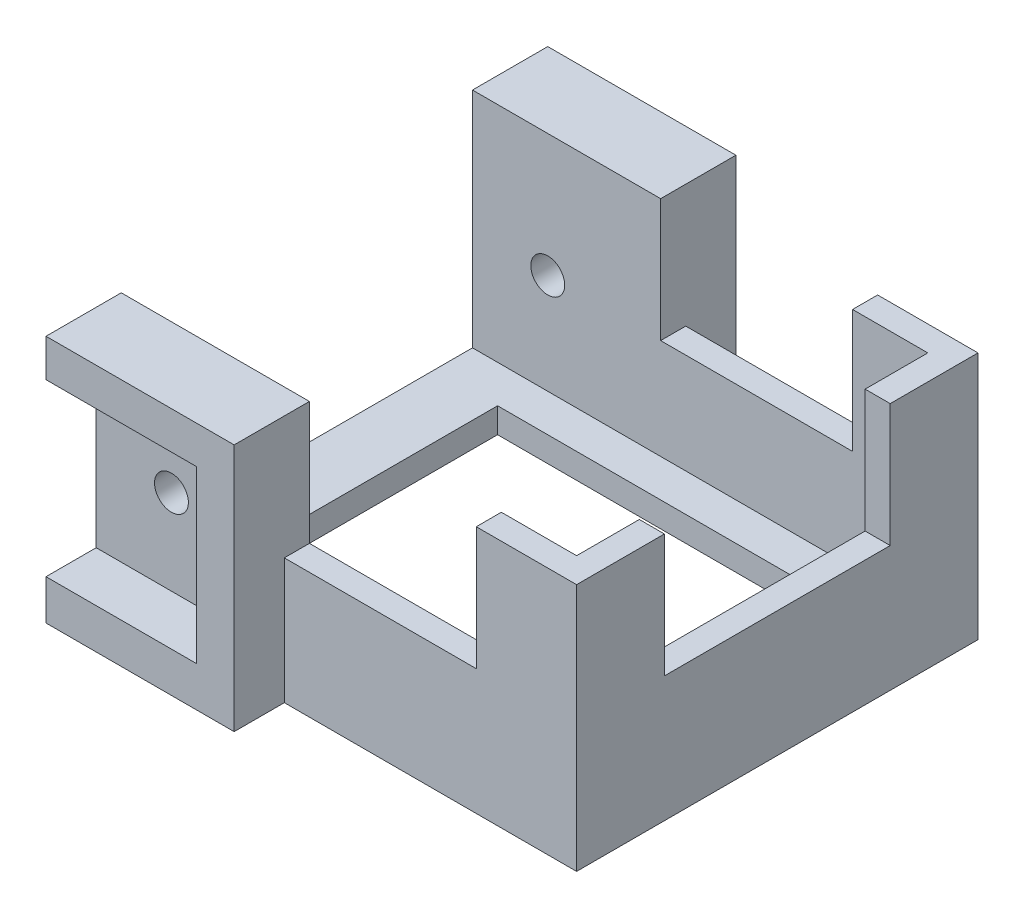
ISO-10303-21;
HEADER;
FILE_DESCRIPTION(('STEP AP214'),'2;1');
FILE_NAME('part.step','',(''),(''),'','','');
FILE_SCHEMA(('AUTOMOTIVE_DESIGN { 1 0 10303 214 1 1 1 1 }'));
ENDSEC;
DATA;
#1=APPLICATION_CONTEXT('core data for automotive mechanical design processes');
#2=APPLICATION_PROTOCOL_DEFINITION('international standard','automotive_design',2000,#1);
#3=PRODUCT_CONTEXT('',#1,'mechanical');
#4=PRODUCT('Part','Part','',(#3));
#5=PRODUCT_RELATED_PRODUCT_CATEGORY('part','',(#4));
#6=PRODUCT_DEFINITION_FORMATION('','',#4);
#7=PRODUCT_DEFINITION_CONTEXT('part definition',#1,'design');
#8=PRODUCT_DEFINITION('design','',#6,#7);
#9=PRODUCT_DEFINITION_SHAPE('','',#8);
#10=(LENGTH_UNIT() NAMED_UNIT(*) SI_UNIT(.MILLI.,.METRE.));
#11=(NAMED_UNIT(*) PLANE_ANGLE_UNIT() SI_UNIT($,.RADIAN.));
#12=(NAMED_UNIT(*) SI_UNIT($,.STERADIAN.) SOLID_ANGLE_UNIT());
#13=UNCERTAINTY_MEASURE_WITH_UNIT(LENGTH_MEASURE(1.E-05),#10,'distance_accuracy_value','');
#14=(GEOMETRIC_REPRESENTATION_CONTEXT(3) GLOBAL_UNCERTAINTY_ASSIGNED_CONTEXT((#13)) GLOBAL_UNIT_ASSIGNED_CONTEXT((#10,
#11,#12)) REPRESENTATION_CONTEXT('',''));
#15=CARTESIAN_POINT('',(0.,0.,0.));
#16=DIRECTION('',(0.,0.,1.));
#17=DIRECTION('',(1.,0.,0.));
#18=AXIS2_PLACEMENT_3D('',#15,#16,#17);
#19=CARTESIAN_POINT('',(-19.15,2.,-16.));
#20=DIRECTION('',(0.,0.,1.));
#21=DIRECTION('',(1.,0.,0.));
#22=AXIS2_PLACEMENT_3D('',#19,#20,#21);
#23=PLANE('',#22);
#24=DIRECTION('',(0.,1.,0.));
#25=VECTOR('',#24,1.);
#26=CARTESIAN_POINT('',(11.15,62.,-16.));
#27=LINE('',#26,#25);
#28=CARTESIAN_POINT('',(11.15,10.,-16.));
#29=VERTEX_POINT('',#28);
#30=CARTESIAN_POINT('',(11.15,19.8,-16.));
#31=VERTEX_POINT('',#30);
#32=EDGE_CURVE('E368',#29,#31,#27,.T.);
#33=ORIENTED_EDGE('',*,*,#32,.T.);
#34=DIRECTION('',(-1.,0.,0.));
#35=VECTOR('',#34,1.);
#36=CARTESIAN_POINT('',(-19.15,19.8,-16.));
#37=LINE('',#36,#35);
#38=CARTESIAN_POINT('',(19.15,19.8,-16.));
#39=VERTEX_POINT('',#38);
#40=EDGE_CURVE('E271',#39,#31,#37,.T.);
#41=ORIENTED_EDGE('',*,*,#40,.F.);
#42=DIRECTION('',(0.,-1.,0.));
#43=VECTOR('',#42,1.);
#44=CARTESIAN_POINT('',(19.15,2.,-16.));
#45=LINE('',#44,#43);
#46=CARTESIAN_POINT('',(19.15,0.,-16.));
#47=VERTEX_POINT('',#46);
#48=EDGE_CURVE('E291',#39,#47,#45,.T.);
#49=ORIENTED_EDGE('',*,*,#48,.T.);
#50=DIRECTION('',(-1.,0.,0.));
#51=VECTOR('',#50,1.);
#52=CARTESIAN_POINT('',(-19.15,0.,-16.));
#53=LINE('',#52,#51);
#54=CARTESIAN_POINT('',(-4.15,0.,-16.));
#55=VERTEX_POINT('',#54);
#56=EDGE_CURVE('E416',#47,#55,#53,.T.);
#57=ORIENTED_EDGE('',*,*,#56,.T.);
#58=DIRECTION('',(0.,1.,0.));
#59=VECTOR('',#58,1.);
#60=CARTESIAN_POINT('',(-4.15,19.8,-16.));
#61=LINE('',#60,#59);
#62=CARTESIAN_POINT('',(-4.15,10.,-16.));
#63=VERTEX_POINT('',#62);
#64=EDGE_CURVE('E537',#55,#63,#61,.T.);
#65=ORIENTED_EDGE('',*,*,#64,.T.);
#66=DIRECTION('',(1.,0.,0.));
#67=VECTOR('',#66,1.);
#68=CARTESIAN_POINT('',(-4.14999999999999,10.,-16.));
#69=LINE('',#68,#67);
#70=EDGE_CURVE('E365',#63,#29,#69,.T.);
#71=ORIENTED_EDGE('',*,*,#70,.T.);
#72=EDGE_LOOP('',(#33,#41,#49,#57,#65,#71));
#73=FACE_BOUND('',#72,.T.);
#74=ADVANCED_FACE('F35',(#73),#23,.F.);
#75=CARTESIAN_POINT('',(-19.15,2.,16.));
#76=DIRECTION('',(0.,0.,-1.));
#77=DIRECTION('',(-1.,0.,0.));
#78=AXIS2_PLACEMENT_3D('',#75,#76,#77);
#79=PLANE('',#78);
#80=CARTESIAN_POINT('',(-13.15,10.,16.));
#81=DIRECTION('',(0.,0.,1.));
#82=DIRECTION('',(1.,0.,0.));
#83=AXIS2_PLACEMENT_3D('',#80,#81,#82);
#84=CIRCLE('',#83,1.35);
#85=CARTESIAN_POINT('',(-11.8,10.,16.));
#86=VERTEX_POINT('',#85);
#87=EDGE_CURVE('E390',#86,#86,#84,.T.);
#88=ORIENTED_EDGE('',*,*,#87,.F.);
#89=EDGE_LOOP('',(#88));
#90=FACE_BOUND('',#89,.T.);
#91=DIRECTION('',(-1.,0.,0.));
#92=VECTOR('',#91,1.);
#93=CARTESIAN_POINT('',(-19.15,3.2,16.));
#94=LINE('',#93,#92);
#95=CARTESIAN_POINT('',(-7.15,3.2,16.));
#96=VERTEX_POINT('',#95);
#97=CARTESIAN_POINT('',(-19.15,3.2,16.));
#98=VERTEX_POINT('',#97);
#99=EDGE_CURVE('E444',#96,#98,#94,.T.);
#100=ORIENTED_EDGE('',*,*,#99,.F.);
#101=DIRECTION('',(0.,-1.,0.));
#102=VECTOR('',#101,1.);
#103=CARTESIAN_POINT('',(-7.15,16.8,16.));
#104=LINE('',#103,#102);
#105=CARTESIAN_POINT('',(-7.15,16.8,16.));
#106=VERTEX_POINT('',#105);
#107=EDGE_CURVE('E446',#106,#96,#104,.T.);
#108=ORIENTED_EDGE('',*,*,#107,.F.);
#109=DIRECTION('',(1.,0.,0.));
#110=VECTOR('',#109,1.);
#111=CARTESIAN_POINT('',(-19.15,16.8,16.));
#112=LINE('',#111,#110);
#113=CARTESIAN_POINT('',(-19.15,16.8,16.));
#114=VERTEX_POINT('',#113);
#115=EDGE_CURVE('E465',#114,#106,#112,.T.);
#116=ORIENTED_EDGE('',*,*,#115,.F.);
#117=DIRECTION('',(0.,-1.,0.));
#118=VECTOR('',#117,1.);
#119=CARTESIAN_POINT('',(-19.15,2.,16.));
#120=LINE('',#119,#118);
#121=EDGE_CURVE('E278',#114,#98,#120,.T.);
#122=ORIENTED_EDGE('',*,*,#121,.T.);
#123=EDGE_LOOP('',(#100,#108,#116,#122));
#124=FACE_BOUND('',#123,.T.);
#125=ADVANCED_FACE('F617',(#90,#124),#79,.F.);
#126=DIRECTION('',(0.,-1.,0.));
#127=VECTOR('',#126,1.);
#128=CARTESIAN_POINT('',(19.15,2.,16.));
#129=LINE('',#128,#127);
#130=CARTESIAN_POINT('',(19.15,19.8,16.));
#131=VERTEX_POINT('',#130);
#132=CARTESIAN_POINT('',(19.15,0.,16.));
#133=VERTEX_POINT('',#132);
#134=EDGE_CURVE('E267',#131,#133,#129,.T.);
#135=ORIENTED_EDGE('',*,*,#134,.F.);
#136=DIRECTION('',(1.,0.,0.));
#137=VECTOR('',#136,1.);
#138=CARTESIAN_POINT('',(-19.15,19.8,16.));
#139=LINE('',#138,#137);
#140=CARTESIAN_POINT('',(11.15,19.8,16.));
#141=VERTEX_POINT('',#140);
#142=EDGE_CURVE('E253',#141,#131,#139,.T.);
#143=ORIENTED_EDGE('',*,*,#142,.F.);
#144=DIRECTION('',(0.,1.,0.));
#145=VECTOR('',#144,1.);
#146=CARTESIAN_POINT('',(11.15,62.,16.));
#147=LINE('',#146,#145);
#148=CARTESIAN_POINT('',(11.15,10.,16.));
#149=VERTEX_POINT('',#148);
#150=EDGE_CURVE('E369',#149,#141,#147,.T.);
#151=ORIENTED_EDGE('',*,*,#150,.F.);
#152=DIRECTION('',(1.,0.,0.));
#153=VECTOR('',#152,1.);
#154=CARTESIAN_POINT('',(-4.14999999999999,10.,16.));
#155=LINE('',#154,#153);
#156=CARTESIAN_POINT('',(-4.14999999999999,10.,16.));
#157=VERTEX_POINT('',#156);
#158=EDGE_CURVE('E364',#157,#149,#155,.T.);
#159=ORIENTED_EDGE('',*,*,#158,.F.);
#160=DIRECTION('',(0.,1.,0.));
#161=VECTOR('',#160,1.);
#162=CARTESIAN_POINT('',(-4.15,19.8,16.));
#163=LINE('',#162,#161);
#164=CARTESIAN_POINT('',(-4.15,0.,16.));
#165=VERTEX_POINT('',#164);
#166=EDGE_CURVE('E463',#165,#157,#163,.T.);
#167=ORIENTED_EDGE('',*,*,#166,.F.);
#168=DIRECTION('',(1.,0.,0.));
#169=VECTOR('',#168,1.);
#170=CARTESIAN_POINT('',(-19.15,0.,16.));
#171=LINE('',#170,#169);
#172=EDGE_CURVE('E276',#165,#133,#171,.T.);
#173=ORIENTED_EDGE('',*,*,#172,.T.);
#174=EDGE_LOOP('',(#135,#143,#151,#159,#167,#173));
#175=FACE_BOUND('',#174,.T.);
#176=ADVANCED_FACE('F273',(#175),#79,.F.);
#177=CARTESIAN_POINT('',(19.15,2.,-16.));
#178=DIRECTION('',(-1.,0.,0.));
#179=DIRECTION('',(0.,0.,1.));
#180=AXIS2_PLACEMENT_3D('',#177,#178,#179);
#181=PLANE('',#180);
#182=ORIENTED_EDGE('',*,*,#48,.F.);
#183=DIRECTION('',(0.,0.,-1.));
#184=VECTOR('',#183,1.);
#185=CARTESIAN_POINT('',(19.15,19.8,-16.));
#186=LINE('',#185,#184);
#187=CARTESIAN_POINT('',(19.15,19.8,-9.00000000000001));
#188=VERTEX_POINT('',#187);
#189=EDGE_CURVE('E261',#188,#39,#186,.T.);
#190=ORIENTED_EDGE('',*,*,#189,.F.);
#191=DIRECTION('',(0.,1.,0.));
#192=VECTOR('',#191,1.);
#193=CARTESIAN_POINT('',(19.15,67.,-9.00000000000001));
#194=LINE('',#193,#192);
#195=CARTESIAN_POINT('',(19.15,10.,-9.00000000000001));
#196=VERTEX_POINT('',#195);
#197=EDGE_CURVE('E328',#196,#188,#194,.T.);
#198=ORIENTED_EDGE('',*,*,#197,.F.);
#199=DIRECTION('',(0.,0.,-1.));
#200=VECTOR('',#199,1.);
#201=CARTESIAN_POINT('',(19.15,10.,8.99999999999999));
#202=LINE('',#201,#200);
#203=CARTESIAN_POINT('',(19.15,10.,8.99999999999999));
#204=VERTEX_POINT('',#203);
#205=EDGE_CURVE('E333',#204,#196,#202,.T.);
#206=ORIENTED_EDGE('',*,*,#205,.F.);
#207=DIRECTION('',(0.,-1.,0.));
#208=VECTOR('',#207,1.);
#209=CARTESIAN_POINT('',(19.15,67.,8.99999999999999));
#210=LINE('',#209,#208);
#211=CARTESIAN_POINT('',(19.15,19.8,8.99999999999999));
#212=VERTEX_POINT('',#211);
#213=EDGE_CURVE('E270',#212,#204,#210,.T.);
#214=ORIENTED_EDGE('',*,*,#213,.F.);
#215=EDGE_CURVE('E50',#131,#212,#186,.T.);
#216=ORIENTED_EDGE('',*,*,#215,.F.);
#217=ORIENTED_EDGE('',*,*,#134,.T.);
#218=DIRECTION('',(0.,0.,-1.));
#219=VECTOR('',#218,1.);
#220=CARTESIAN_POINT('',(19.15,0.,-16.));
#221=LINE('',#220,#219);
#222=EDGE_CURVE('E413',#133,#47,#221,.T.);
#223=ORIENTED_EDGE('',*,*,#222,.T.);
#224=EDGE_LOOP('',(#182,#190,#198,#206,#214,#216,#217,#223));
#225=FACE_BOUND('',#224,.T.);
#226=ADVANCED_FACE('F37',(#225),#181,.F.);
#227=CARTESIAN_POINT('',(-13.15,10.,-16.));
#228=DIRECTION('',(0.,0.,1.));
#229=DIRECTION('',(1.,0.,0.));
#230=AXIS2_PLACEMENT_3D('',#227,#228,#229);
#231=CIRCLE('',#230,1.35);
#232=CARTESIAN_POINT('',(-11.8,10.,-16.));
#233=VERTEX_POINT('',#232);
#234=EDGE_CURVE('E298',#233,#233,#231,.T.);
#235=ORIENTED_EDGE('',*,*,#234,.T.);
#236=EDGE_LOOP('',(#235));
#237=FACE_BOUND('',#236,.T.);
#238=DIRECTION('',(0.,-1.,0.));
#239=VECTOR('',#238,1.);
#240=CARTESIAN_POINT('',(-19.15,2.,-16.));
#241=LINE('',#240,#239);
#242=CARTESIAN_POINT('',(-19.15,16.8,-16.));
#243=VERTEX_POINT('',#242);
#244=CARTESIAN_POINT('',(-19.15,3.2,-16.));
#245=VERTEX_POINT('',#244);
#246=EDGE_CURVE('E282',#243,#245,#241,.T.);
#247=ORIENTED_EDGE('',*,*,#246,.F.);
#248=DIRECTION('',(1.,0.,0.));
#249=VECTOR('',#248,1.);
#250=CARTESIAN_POINT('',(-19.15,16.8,-16.));
#251=LINE('',#250,#249);
#252=CARTESIAN_POINT('',(-7.15,16.8,-16.));
#253=VERTEX_POINT('',#252);
#254=EDGE_CURVE('E585',#243,#253,#251,.T.);
#255=ORIENTED_EDGE('',*,*,#254,.T.);
#256=DIRECTION('',(0.,-1.,0.));
#257=VECTOR('',#256,1.);
#258=CARTESIAN_POINT('',(-7.15,16.8,-16.));
#259=LINE('',#258,#257);
#260=CARTESIAN_POINT('',(-7.15,3.2,-16.));
#261=VERTEX_POINT('',#260);
#262=EDGE_CURVE('E523',#253,#261,#259,.T.);
#263=ORIENTED_EDGE('',*,*,#262,.T.);
#264=DIRECTION('',(-1.,0.,0.));
#265=VECTOR('',#264,1.);
#266=CARTESIAN_POINT('',(-19.15,3.2,-16.));
#267=LINE('',#266,#265);
#268=EDGE_CURVE('E521',#261,#245,#267,.T.);
#269=ORIENTED_EDGE('',*,*,#268,.T.);
#270=EDGE_LOOP('',(#247,#255,#263,#269));
#271=FACE_BOUND('',#270,.T.);
#272=ADVANCED_FACE('F578',(#237,#271),#23,.F.);
#273=CARTESIAN_POINT('',(-19.15,2.,-16.));
#274=DIRECTION('',(1.,0.,0.));
#275=DIRECTION('',(0.,0.,-1.));
#276=AXIS2_PLACEMENT_3D('',#273,#274,#275);
#277=PLANE('',#276);
#278=DIRECTION('',(0.,0.,-1.));
#279=VECTOR('',#278,1.);
#280=CARTESIAN_POINT('',(-19.15,19.8,20.));
#281=LINE('',#280,#279);
#282=CARTESIAN_POINT('',(-19.15,19.8,20.));
#283=VERTEX_POINT('',#282);
#284=CARTESIAN_POINT('',(-19.15,19.8,14.));
#285=VERTEX_POINT('',#284);
#286=EDGE_CURVE('E477',#283,#285,#281,.T.);
#287=ORIENTED_EDGE('',*,*,#286,.T.);
#288=DIRECTION('',(0.,-1.,0.));
#289=VECTOR('',#288,1.);
#290=CARTESIAN_POINT('',(-19.15,77.,14.));
#291=LINE('',#290,#289);
#292=CARTESIAN_POINT('',(-19.15,2.,14.));
#293=VERTEX_POINT('',#292);
#294=EDGE_CURVE('E406',#285,#293,#291,.T.);
#295=ORIENTED_EDGE('',*,*,#294,.T.);
#296=DIRECTION('',(0.,0.,1.));
#297=VECTOR('',#296,1.);
#298=CARTESIAN_POINT('',(-19.15,2.,-16.));
#299=LINE('',#298,#297);
#300=CARTESIAN_POINT('',(-19.15,2.,-14.));
#301=VERTEX_POINT('',#300);
#302=EDGE_CURVE('E279',#301,#293,#299,.T.);
#303=ORIENTED_EDGE('',*,*,#302,.F.);
#304=DIRECTION('',(0.,-1.,0.));
#305=VECTOR('',#304,1.);
#306=CARTESIAN_POINT('',(-19.15,77.,-14.));
#307=LINE('',#306,#305);
#308=CARTESIAN_POINT('',(-19.15,19.8,-14.));
#309=VERTEX_POINT('',#308);
#310=EDGE_CURVE('E412',#309,#301,#307,.T.);
#311=ORIENTED_EDGE('',*,*,#310,.F.);
#312=DIRECTION('',(0.,0.,1.));
#313=VECTOR('',#312,1.);
#314=CARTESIAN_POINT('',(-19.15,19.8,-20.));
#315=LINE('',#314,#313);
#316=CARTESIAN_POINT('',(-19.15,19.8,-20.));
#317=VERTEX_POINT('',#316);
#318=EDGE_CURVE('E552',#317,#309,#315,.T.);
#319=ORIENTED_EDGE('',*,*,#318,.F.);
#320=DIRECTION('',(0.,-1.,0.));
#321=VECTOR('',#320,1.);
#322=CARTESIAN_POINT('',(-19.15,16.8,-20.));
#323=LINE('',#322,#321);
#324=CARTESIAN_POINT('',(-19.15,16.8,-20.));
#325=VERTEX_POINT('',#324);
#326=EDGE_CURVE('E581',#317,#325,#323,.T.);
#327=ORIENTED_EDGE('',*,*,#326,.T.);
#328=DIRECTION('',(0.,0.,1.));
#329=VECTOR('',#328,1.);
#330=CARTESIAN_POINT('',(-19.15,16.8,-20.));
#331=LINE('',#330,#329);
#332=EDGE_CURVE('E559',#325,#243,#331,.T.);
#333=ORIENTED_EDGE('',*,*,#332,.T.);
#334=ORIENTED_EDGE('',*,*,#246,.T.);
#335=DIRECTION('',(0.,0.,1.));
#336=VECTOR('',#335,1.);
#337=CARTESIAN_POINT('',(-19.15,3.2,-20.));
#338=LINE('',#337,#336);
#339=CARTESIAN_POINT('',(-19.15,3.2,-20.));
#340=VERTEX_POINT('',#339);
#341=EDGE_CURVE('E449',#340,#245,#338,.T.);
#342=ORIENTED_EDGE('',*,*,#341,.F.);
#343=DIRECTION('',(0.,-1.,0.));
#344=VECTOR('',#343,1.);
#345=CARTESIAN_POINT('',(-19.15,0.,-20.));
#346=LINE('',#345,#344);
#347=CARTESIAN_POINT('',(-19.15,0.,-20.));
#348=VERTEX_POINT('',#347);
#349=EDGE_CURVE('E428',#340,#348,#346,.T.);
#350=ORIENTED_EDGE('',*,*,#349,.T.);
#351=DIRECTION('',(0.,0.,1.));
#352=VECTOR('',#351,1.);
#353=CARTESIAN_POINT('',(-19.15,0.,-16.));
#354=LINE('',#353,#352);
#355=CARTESIAN_POINT('',(-19.15,0.,20.));
#356=VERTEX_POINT('',#355);
#357=EDGE_CURVE('E418',#348,#356,#354,.T.);
#358=ORIENTED_EDGE('',*,*,#357,.T.);
#359=DIRECTION('',(0.,-1.,0.));
#360=VECTOR('',#359,1.);
#361=CARTESIAN_POINT('',(-19.15,0.,20.));
#362=LINE('',#361,#360);
#363=CARTESIAN_POINT('',(-19.15,3.2,20.));
#364=VERTEX_POINT('',#363);
#365=EDGE_CURVE('E426',#364,#356,#362,.T.);
#366=ORIENTED_EDGE('',*,*,#365,.F.);
#367=DIRECTION('',(0.,0.,-1.));
#368=VECTOR('',#367,1.);
#369=CARTESIAN_POINT('',(-19.15,3.2,20.));
#370=LINE('',#369,#368);
#371=EDGE_CURVE('E462',#364,#98,#370,.T.);
#372=ORIENTED_EDGE('',*,*,#371,.T.);
#373=ORIENTED_EDGE('',*,*,#121,.F.);
#374=DIRECTION('',(0.,0.,-1.));
#375=VECTOR('',#374,1.);
#376=CARTESIAN_POINT('',(-19.15,16.8,20.));
#377=LINE('',#376,#375);
#378=CARTESIAN_POINT('',(-19.15,16.8,20.));
#379=VERTEX_POINT('',#378);
#380=EDGE_CURVE('E475',#379,#114,#377,.T.);
#381=ORIENTED_EDGE('',*,*,#380,.F.);
#382=DIRECTION('',(0.,-1.,0.));
#383=VECTOR('',#382,1.);
#384=CARTESIAN_POINT('',(-19.15,16.8,20.));
#385=LINE('',#384,#383);
#386=EDGE_CURVE('E455',#283,#379,#385,.T.);
#387=ORIENTED_EDGE('',*,*,#386,.F.);
#388=EDGE_LOOP('',(#287,#295,#303,#311,#319,#327,#333,#334,#342,#350,#358,#366,#372,#373,#381,#387));
#389=FACE_BOUND('',#388,.T.);
#390=ADVANCED_FACE('F423',(#389),#277,.F.);
#391=CARTESIAN_POINT('',(0.,2.,0.));
#392=DIRECTION('',(0.,1.,0.));
#393=DIRECTION('',(0.,0.,1.));
#394=AXIS2_PLACEMENT_3D('',#391,#392,#393);
#395=PLANE('',#394);
#396=DIRECTION('',(0.,0.,1.));
#397=VECTOR('',#396,1.);
#398=CARTESIAN_POINT('',(-14.15,2.,0.));
#399=LINE('',#398,#397);
#400=CARTESIAN_POINT('',(-14.15,2.,-11.));
#401=VERTEX_POINT('',#400);
#402=CARTESIAN_POINT('',(-14.15,2.,11.));
#403=VERTEX_POINT('',#402);
#404=EDGE_CURVE('E362',#401,#403,#399,.T.);
#405=ORIENTED_EDGE('',*,*,#404,.F.);
#406=DIRECTION('',(-1.,0.,0.));
#407=VECTOR('',#406,1.);
#408=CARTESIAN_POINT('',(0.,2.,-11.));
#409=LINE('',#408,#407);
#410=CARTESIAN_POINT('',(14.15,2.,-11.));
#411=VERTEX_POINT('',#410);
#412=EDGE_CURVE('E349',#411,#401,#409,.T.);
#413=ORIENTED_EDGE('',*,*,#412,.F.);
#414=DIRECTION('',(0.,0.,-1.));
#415=VECTOR('',#414,1.);
#416=CARTESIAN_POINT('',(14.15,2.,0.));
#417=LINE('',#416,#415);
#418=CARTESIAN_POINT('',(14.15,2.,11.));
#419=VERTEX_POINT('',#418);
#420=EDGE_CURVE('E357',#419,#411,#417,.T.);
#421=ORIENTED_EDGE('',*,*,#420,.F.);
#422=DIRECTION('',(1.,0.,0.));
#423=VECTOR('',#422,1.);
#424=CARTESIAN_POINT('',(0.,2.,11.));
#425=LINE('',#424,#423);
#426=EDGE_CURVE('E360',#403,#419,#425,.T.);
#427=ORIENTED_EDGE('',*,*,#426,.F.);
#428=EDGE_LOOP('',(#405,#413,#421,#427));
#429=FACE_BOUND('',#428,.T.);
#430=DIRECTION('',(-1.,0.,0.));
#431=VECTOR('',#430,1.);
#432=CARTESIAN_POINT('',(-19.15,2.,14.));
#433=LINE('',#432,#431);
#434=CARTESIAN_POINT('',(17.15,2.,14.));
#435=VERTEX_POINT('',#434);
#436=EDGE_CURVE('E403',#435,#293,#433,.T.);
#437=ORIENTED_EDGE('',*,*,#436,.F.);
#438=DIRECTION('',(0.,0.,1.));
#439=VECTOR('',#438,1.);
#440=CARTESIAN_POINT('',(17.15,2.,14.));
#441=LINE('',#440,#439);
#442=CARTESIAN_POINT('',(17.15,2.,-14.));
#443=VERTEX_POINT('',#442);
#444=EDGE_CURVE('E400',#443,#435,#441,.T.);
#445=ORIENTED_EDGE('',*,*,#444,.F.);
#446=DIRECTION('',(1.,0.,0.));
#447=VECTOR('',#446,1.);
#448=CARTESIAN_POINT('',(17.15,2.,-14.));
#449=LINE('',#448,#447);
#450=EDGE_CURVE('E397',#301,#443,#449,.T.);
#451=ORIENTED_EDGE('',*,*,#450,.F.);
#452=ORIENTED_EDGE('',*,*,#302,.T.);
#453=EDGE_LOOP('',(#437,#445,#451,#452));
#454=FACE_BOUND('',#453,.T.);
#455=ADVANCED_FACE('F502',(#429,#454),#395,.T.);
#456=CARTESIAN_POINT('',(0.,0.,0.));
#457=DIRECTION('',(0.,1.,0.));
#458=DIRECTION('',(0.,0.,1.));
#459=AXIS2_PLACEMENT_3D('',#456,#457,#458);
#460=PLANE('',#459);
#461=DIRECTION('',(1.,0.,0.));
#462=VECTOR('',#461,1.);
#463=CARTESIAN_POINT('',(-14.15,0.,-11.));
#464=LINE('',#463,#462);
#465=CARTESIAN_POINT('',(-14.15,0.,-11.));
#466=VERTEX_POINT('',#465);
#467=CARTESIAN_POINT('',(14.15,0.,-11.));
#468=VERTEX_POINT('',#467);
#469=EDGE_CURVE('E337',#466,#468,#464,.T.);
#470=ORIENTED_EDGE('',*,*,#469,.F.);
#471=DIRECTION('',(0.,0.,-1.));
#472=VECTOR('',#471,1.);
#473=CARTESIAN_POINT('',(-14.15,0.,11.));
#474=LINE('',#473,#472);
#475=CARTESIAN_POINT('',(-14.15,0.,11.));
#476=VERTEX_POINT('',#475);
#477=EDGE_CURVE('E330',#476,#466,#474,.T.);
#478=ORIENTED_EDGE('',*,*,#477,.F.);
#479=DIRECTION('',(-1.,0.,0.));
#480=VECTOR('',#479,1.);
#481=CARTESIAN_POINT('',(-14.15,0.,11.));
#482=LINE('',#481,#480);
#483=CARTESIAN_POINT('',(14.15,0.,11.));
#484=VERTEX_POINT('',#483);
#485=EDGE_CURVE('E343',#484,#476,#482,.T.);
#486=ORIENTED_EDGE('',*,*,#485,.F.);
#487=DIRECTION('',(0.,0.,1.));
#488=VECTOR('',#487,1.);
#489=CARTESIAN_POINT('',(14.15,0.,11.));
#490=LINE('',#489,#488);
#491=EDGE_CURVE('E340',#468,#484,#490,.T.);
#492=ORIENTED_EDGE('',*,*,#491,.F.);
#493=EDGE_LOOP('',(#470,#478,#486,#492));
#494=FACE_BOUND('',#493,.T.);
#495=ORIENTED_EDGE('',*,*,#222,.F.);
#496=ORIENTED_EDGE('',*,*,#172,.F.);
#497=DIRECTION('',(0.,0.,-1.));
#498=VECTOR('',#497,1.);
#499=CARTESIAN_POINT('',(-4.15,0.,20.));
#500=LINE('',#499,#498);
#501=CARTESIAN_POINT('',(-4.15,0.,20.));
#502=VERTEX_POINT('',#501);
#503=EDGE_CURVE('E435',#502,#165,#500,.T.);
#504=ORIENTED_EDGE('',*,*,#503,.F.);
#505=DIRECTION('',(1.,0.,0.));
#506=VECTOR('',#505,1.);
#507=CARTESIAN_POINT('',(-19.15,0.,20.));
#508=LINE('',#507,#506);
#509=EDGE_CURVE('E433',#356,#502,#508,.T.);
#510=ORIENTED_EDGE('',*,*,#509,.F.);
#511=ORIENTED_EDGE('',*,*,#357,.F.);
#512=DIRECTION('',(1.,0.,0.));
#513=VECTOR('',#512,1.);
#514=CARTESIAN_POINT('',(-19.15,0.,-20.));
#515=LINE('',#514,#513);
#516=CARTESIAN_POINT('',(-4.15,0.,-20.));
#517=VERTEX_POINT('',#516);
#518=EDGE_CURVE('E590',#348,#517,#515,.T.);
#519=ORIENTED_EDGE('',*,*,#518,.T.);
#520=DIRECTION('',(0.,0.,1.));
#521=VECTOR('',#520,1.);
#522=CARTESIAN_POINT('',(-4.15,0.,-20.));
#523=LINE('',#522,#521);
#524=EDGE_CURVE('E553',#517,#55,#523,.T.);
#525=ORIENTED_EDGE('',*,*,#524,.T.);
#526=ORIENTED_EDGE('',*,*,#56,.F.);
#527=EDGE_LOOP('',(#495,#496,#504,#510,#511,#519,#525,#526));
#528=FACE_BOUND('',#527,.T.);
#529=ADVANCED_FACE('F434',(#494,#528),#460,.F.);
#530=CARTESIAN_POINT('',(17.15,77.,-14.));
#531=DIRECTION('',(0.,0.,-1.));
#532=DIRECTION('',(-1.,0.,0.));
#533=AXIS2_PLACEMENT_3D('',#530,#531,#532);
#534=PLANE('',#533);
#535=DIRECTION('',(0.,-1.,0.));
#536=VECTOR('',#535,1.);
#537=CARTESIAN_POINT('',(17.15,77.,-14.));
#538=LINE('',#537,#536);
#539=CARTESIAN_POINT('',(17.15,19.8,-14.));
#540=VERTEX_POINT('',#539);
#541=EDGE_CURVE('E410',#540,#443,#538,.T.);
#542=ORIENTED_EDGE('',*,*,#541,.F.);
#543=DIRECTION('',(-1.,0.,0.));
#544=VECTOR('',#543,1.);
#545=CARTESIAN_POINT('',(17.15,19.8,-14.));
#546=LINE('',#545,#544);
#547=CARTESIAN_POINT('',(11.15,19.8,-14.));
#548=VERTEX_POINT('',#547);
#549=EDGE_CURVE('E489',#540,#548,#546,.T.);
#550=ORIENTED_EDGE('',*,*,#549,.T.);
#551=DIRECTION('',(0.,-1.,0.));
#552=VECTOR('',#551,1.);
#553=CARTESIAN_POINT('',(11.15,77.,-14.));
#554=LINE('',#553,#552);
#555=CARTESIAN_POINT('',(11.15,10.,-14.));
#556=VERTEX_POINT('',#555);
#557=EDGE_CURVE('E385',#548,#556,#554,.T.);
#558=ORIENTED_EDGE('',*,*,#557,.T.);
#559=DIRECTION('',(-1.,0.,0.));
#560=VECTOR('',#559,1.);
#561=CARTESIAN_POINT('',(17.15,9.99999999999999,-14.));
#562=LINE('',#561,#560);
#563=CARTESIAN_POINT('',(-4.14999999999999,9.99999999999999,-14.));
#564=VERTEX_POINT('',#563);
#565=EDGE_CURVE('E379',#556,#564,#562,.T.);
#566=ORIENTED_EDGE('',*,*,#565,.T.);
#567=DIRECTION('',(0.,1.,0.));
#568=VECTOR('',#567,1.);
#569=CARTESIAN_POINT('',(-4.15,77.,-14.));
#570=LINE('',#569,#568);
#571=CARTESIAN_POINT('',(-4.14999999999999,19.8,-14.));
#572=VERTEX_POINT('',#571);
#573=EDGE_CURVE('E387',#564,#572,#570,.T.);
#574=ORIENTED_EDGE('',*,*,#573,.T.);
#575=EDGE_CURVE('E517',#572,#309,#546,.T.);
#576=ORIENTED_EDGE('',*,*,#575,.T.);
#577=ORIENTED_EDGE('',*,*,#310,.T.);
#578=ORIENTED_EDGE('',*,*,#450,.T.);
#579=EDGE_LOOP('',(#542,#550,#558,#566,#574,#576,#577,#578));
#580=FACE_BOUND('',#579,.T.);
#581=CARTESIAN_POINT('',(-13.15,10.,-14.));
#582=DIRECTION('',(0.,0.,-1.));
#583=DIRECTION('',(-1.,0.,0.));
#584=AXIS2_PLACEMENT_3D('',#581,#582,#583);
#585=CIRCLE('',#584,1.35);
#586=CARTESIAN_POINT('',(-14.5,10.,-14.));
#587=VERTEX_POINT('',#586);
#588=EDGE_CURVE('E297',#587,#587,#585,.T.);
#589=ORIENTED_EDGE('',*,*,#588,.T.);
#590=EDGE_LOOP('',(#589));
#591=FACE_BOUND('',#590,.T.);
#592=ADVANCED_FACE('F493',(#580,#591),#534,.F.);
#593=CARTESIAN_POINT('',(17.15,77.,14.));
#594=DIRECTION('',(1.,0.,0.));
#595=DIRECTION('',(0.,0.,-1.));
#596=AXIS2_PLACEMENT_3D('',#593,#594,#595);
#597=PLANE('',#596);
#598=DIRECTION('',(0.,-1.,0.));
#599=VECTOR('',#598,1.);
#600=CARTESIAN_POINT('',(17.15,77.,14.));
#601=LINE('',#600,#599);
#602=CARTESIAN_POINT('',(17.15,19.8,14.));
#603=VERTEX_POINT('',#602);
#604=EDGE_CURVE('E408',#603,#435,#601,.T.);
#605=ORIENTED_EDGE('',*,*,#604,.F.);
#606=DIRECTION('',(0.,0.,-1.));
#607=VECTOR('',#606,1.);
#608=CARTESIAN_POINT('',(17.15,19.8,14.));
#609=LINE('',#608,#607);
#610=CARTESIAN_POINT('',(17.15,19.8,8.99999999999999));
#611=VERTEX_POINT('',#610);
#612=EDGE_CURVE('E317',#603,#611,#609,.T.);
#613=ORIENTED_EDGE('',*,*,#612,.T.);
#614=DIRECTION('',(0.,-1.,0.));
#615=VECTOR('',#614,1.);
#616=CARTESIAN_POINT('',(17.15,77.,9.));
#617=LINE('',#616,#615);
#618=CARTESIAN_POINT('',(17.15,10.,8.99999999999999));
#619=VERTEX_POINT('',#618);
#620=EDGE_CURVE('E43',#611,#619,#617,.T.);
#621=ORIENTED_EDGE('',*,*,#620,.T.);
#622=DIRECTION('',(0.,0.,-1.));
#623=VECTOR('',#622,1.);
#624=CARTESIAN_POINT('',(17.15,9.99999999999999,14.));
#625=LINE('',#624,#623);
#626=CARTESIAN_POINT('',(17.15,10.,-9.00000000000001));
#627=VERTEX_POINT('',#626);
#628=EDGE_CURVE('E306',#619,#627,#625,.T.);
#629=ORIENTED_EDGE('',*,*,#628,.T.);
#630=DIRECTION('',(0.,1.,0.));
#631=VECTOR('',#630,1.);
#632=CARTESIAN_POINT('',(17.15,77.,-9.00000000000001));
#633=LINE('',#632,#631);
#634=CARTESIAN_POINT('',(17.15,19.8,-9.00000000000001));
#635=VERTEX_POINT('',#634);
#636=EDGE_CURVE('E309',#627,#635,#633,.T.);
#637=ORIENTED_EDGE('',*,*,#636,.T.);
#638=EDGE_CURVE('E58',#635,#540,#609,.T.);
#639=ORIENTED_EDGE('',*,*,#638,.T.);
#640=ORIENTED_EDGE('',*,*,#541,.T.);
#641=ORIENTED_EDGE('',*,*,#444,.T.);
#642=EDGE_LOOP('',(#605,#613,#621,#629,#637,#639,#640,#641));
#643=FACE_BOUND('',#642,.T.);
#644=ADVANCED_FACE('F316',(#643),#597,.F.);
#645=CARTESIAN_POINT('',(-19.15,77.,14.));
#646=DIRECTION('',(0.,0.,1.));
#647=DIRECTION('',(1.,0.,0.));
#648=AXIS2_PLACEMENT_3D('',#645,#646,#647);
#649=PLANE('',#648);
#650=ORIENTED_EDGE('',*,*,#294,.F.);
#651=DIRECTION('',(1.,0.,0.));
#652=VECTOR('',#651,1.);
#653=CARTESIAN_POINT('',(-19.15,19.8,14.));
#654=LINE('',#653,#652);
#655=CARTESIAN_POINT('',(-4.14999999999999,19.8,14.));
#656=VERTEX_POINT('',#655);
#657=EDGE_CURVE('E511',#285,#656,#654,.T.);
#658=ORIENTED_EDGE('',*,*,#657,.T.);
#659=DIRECTION('',(0.,-1.,0.));
#660=VECTOR('',#659,1.);
#661=CARTESIAN_POINT('',(-4.15,77.,14.));
#662=LINE('',#661,#660);
#663=CARTESIAN_POINT('',(-4.14999999999999,10.,14.));
#664=VERTEX_POINT('',#663);
#665=EDGE_CURVE('E304',#656,#664,#662,.T.);
#666=ORIENTED_EDGE('',*,*,#665,.T.);
#667=DIRECTION('',(1.,0.,0.));
#668=VECTOR('',#667,1.);
#669=CARTESIAN_POINT('',(-19.15,9.99999999999999,14.));
#670=LINE('',#669,#668);
#671=CARTESIAN_POINT('',(11.15,9.99999999999999,14.));
#672=VERTEX_POINT('',#671);
#673=EDGE_CURVE('E293',#664,#672,#670,.T.);
#674=ORIENTED_EDGE('',*,*,#673,.T.);
#675=DIRECTION('',(0.,1.,0.));
#676=VECTOR('',#675,1.);
#677=CARTESIAN_POINT('',(11.15,77.,14.));
#678=LINE('',#677,#676);
#679=CARTESIAN_POINT('',(11.15,19.8,14.));
#680=VERTEX_POINT('',#679);
#681=EDGE_CURVE('E301',#672,#680,#678,.T.);
#682=ORIENTED_EDGE('',*,*,#681,.T.);
#683=EDGE_CURVE('E514',#680,#603,#654,.T.);
#684=ORIENTED_EDGE('',*,*,#683,.T.);
#685=ORIENTED_EDGE('',*,*,#604,.T.);
#686=ORIENTED_EDGE('',*,*,#436,.T.);
#687=EDGE_LOOP('',(#650,#658,#666,#674,#682,#684,#685,#686));
#688=FACE_BOUND('',#687,.T.);
#689=CARTESIAN_POINT('',(-13.15,10.,14.));
#690=DIRECTION('',(0.,0.,1.));
#691=DIRECTION('',(1.,0.,0.));
#692=AXIS2_PLACEMENT_3D('',#689,#690,#691);
#693=CIRCLE('',#692,1.35);
#694=CARTESIAN_POINT('',(-11.8,10.,14.));
#695=VERTEX_POINT('',#694);
#696=EDGE_CURVE('E294',#695,#695,#693,.T.);
#697=ORIENTED_EDGE('',*,*,#696,.T.);
#698=EDGE_LOOP('',(#697));
#699=FACE_BOUND('',#698,.T.);
#700=ADVANCED_FACE('F509',(#688,#699),#649,.F.);
#701=CARTESIAN_POINT('',(-13.15,10.,-16.));
#702=DIRECTION('',(0.,0.,1.));
#703=DIRECTION('',(1.,0.,0.));
#704=AXIS2_PLACEMENT_3D('',#701,#702,#703);
#705=CYLINDRICAL_SURFACE('',#704,1.35);
#706=ORIENTED_EDGE('',*,*,#87,.T.);
#707=EDGE_LOOP('',(#706));
#708=FACE_BOUND('',#707,.T.);
#709=ORIENTED_EDGE('',*,*,#696,.F.);
#710=EDGE_LOOP('',(#709));
#711=FACE_BOUND('',#710,.T.);
#712=ADVANCED_FACE('F639',(#708,#711),#705,.F.);
#713=ORIENTED_EDGE('',*,*,#234,.F.);
#714=EDGE_LOOP('',(#713));
#715=FACE_BOUND('',#714,.T.);
#716=ORIENTED_EDGE('',*,*,#588,.F.);
#717=EDGE_LOOP('',(#716));
#718=FACE_BOUND('',#717,.T.);
#719=ADVANCED_FACE('F635',(#715,#718),#705,.F.);
#720=CARTESIAN_POINT('',(-4.14999999999999,10.,-16.));
#721=DIRECTION('',(0.,-1.,0.));
#722=DIRECTION('',(0.,0.,-1.));
#723=AXIS2_PLACEMENT_3D('',#720,#721,#722);
#724=PLANE('',#723);
#725=DIRECTION('',(0.,0.,1.));
#726=VECTOR('',#725,1.);
#727=CARTESIAN_POINT('',(-4.14999999999999,10.,-16.));
#728=LINE('',#727,#726);
#729=EDGE_CURVE('E372',#664,#157,#728,.T.);
#730=ORIENTED_EDGE('',*,*,#729,.T.);
#731=ORIENTED_EDGE('',*,*,#158,.T.);
#732=DIRECTION('',(0.,0.,1.));
#733=VECTOR('',#732,1.);
#734=CARTESIAN_POINT('',(11.15,10.,-16.));
#735=LINE('',#734,#733);
#736=EDGE_CURVE('E380',#672,#149,#735,.T.);
#737=ORIENTED_EDGE('',*,*,#736,.F.);
#738=ORIENTED_EDGE('',*,*,#673,.F.);
#739=EDGE_LOOP('',(#730,#731,#737,#738));
#740=FACE_BOUND('',#739,.T.);
#741=ADVANCED_FACE('F638',(#740),#724,.F.);
#742=CARTESIAN_POINT('',(11.15,62.,-16.));
#743=DIRECTION('',(1.,0.,0.));
#744=DIRECTION('',(0.,1.,0.));
#745=AXIS2_PLACEMENT_3D('',#742,#743,#744);
#746=PLANE('',#745);
#747=ORIENTED_EDGE('',*,*,#150,.T.);
#748=DIRECTION('',(0.,0.,-1.));
#749=VECTOR('',#748,1.);
#750=CARTESIAN_POINT('',(11.15,19.8,-16.));
#751=LINE('',#750,#749);
#752=EDGE_CURVE('E256',#141,#680,#751,.T.);
#753=ORIENTED_EDGE('',*,*,#752,.T.);
#754=ORIENTED_EDGE('',*,*,#681,.F.);
#755=ORIENTED_EDGE('',*,*,#736,.T.);
#756=EDGE_LOOP('',(#747,#753,#754,#755));
#757=FACE_BOUND('',#756,.T.);
#758=ADVANCED_FACE('F691',(#757),#746,.F.);
#759=CARTESIAN_POINT('',(-4.15,62.,-16.));
#760=DIRECTION('',(-1.,0.,0.));
#761=DIRECTION('',(0.,-1.,0.));
#762=AXIS2_PLACEMENT_3D('',#759,#760,#761);
#763=PLANE('',#762);
#764=ORIENTED_EDGE('',*,*,#665,.F.);
#765=DIRECTION('',(0.,0.,-1.));
#766=VECTOR('',#765,1.);
#767=CARTESIAN_POINT('',(-4.15,19.8,20.));
#768=LINE('',#767,#766);
#769=CARTESIAN_POINT('',(-4.15,19.8,20.));
#770=VERTEX_POINT('',#769);
#771=EDGE_CURVE('E479',#770,#656,#768,.T.);
#772=ORIENTED_EDGE('',*,*,#771,.F.);
#773=DIRECTION('',(0.,1.,0.));
#774=VECTOR('',#773,1.);
#775=CARTESIAN_POINT('',(-4.15,19.8,20.));
#776=LINE('',#775,#774);
#777=EDGE_CURVE('E438',#502,#770,#776,.T.);
#778=ORIENTED_EDGE('',*,*,#777,.F.);
#779=ORIENTED_EDGE('',*,*,#503,.T.);
#780=ORIENTED_EDGE('',*,*,#166,.T.);
#781=ORIENTED_EDGE('',*,*,#729,.F.);
#782=EDGE_LOOP('',(#764,#772,#778,#779,#780,#781));
#783=FACE_BOUND('',#782,.T.);
#784=ADVANCED_FACE('F695',(#783),#763,.F.);
#785=DIRECTION('',(0.,0.,1.));
#786=VECTOR('',#785,1.);
#787=CARTESIAN_POINT('',(-4.15,19.8,-20.));
#788=LINE('',#787,#786);
#789=CARTESIAN_POINT('',(-4.15,19.8,-20.));
#790=VERTEX_POINT('',#789);
#791=EDGE_CURVE('E546',#790,#572,#788,.T.);
#792=ORIENTED_EDGE('',*,*,#791,.T.);
#793=ORIENTED_EDGE('',*,*,#573,.F.);
#794=EDGE_CURVE('E381',#63,#564,#728,.T.);
#795=ORIENTED_EDGE('',*,*,#794,.F.);
#796=ORIENTED_EDGE('',*,*,#64,.F.);
#797=ORIENTED_EDGE('',*,*,#524,.F.);
#798=DIRECTION('',(0.,1.,0.));
#799=VECTOR('',#798,1.);
#800=CARTESIAN_POINT('',(-4.15,19.8,-20.));
#801=LINE('',#800,#799);
#802=EDGE_CURVE('E548',#517,#790,#801,.T.);
#803=ORIENTED_EDGE('',*,*,#802,.T.);
#804=EDGE_LOOP('',(#792,#793,#795,#796,#797,#803));
#805=FACE_BOUND('',#804,.T.);
#806=ADVANCED_FACE('F544',(#805),#763,.F.);
#807=ORIENTED_EDGE('',*,*,#557,.F.);
#808=DIRECTION('',(0.,0.,-1.));
#809=VECTOR('',#808,1.);
#810=CARTESIAN_POINT('',(11.15,19.8,-16.));
#811=LINE('',#810,#809);
#812=EDGE_CURVE('E528',#548,#31,#811,.T.);
#813=ORIENTED_EDGE('',*,*,#812,.T.);
#814=ORIENTED_EDGE('',*,*,#32,.F.);
#815=EDGE_CURVE('E376',#29,#556,#735,.T.);
#816=ORIENTED_EDGE('',*,*,#815,.T.);
#817=EDGE_LOOP('',(#807,#813,#814,#816));
#818=FACE_BOUND('',#817,.T.);
#819=ADVANCED_FACE('F531',(#818),#746,.F.);
#820=ORIENTED_EDGE('',*,*,#815,.F.);
#821=ORIENTED_EDGE('',*,*,#70,.F.);
#822=ORIENTED_EDGE('',*,*,#794,.T.);
#823=ORIENTED_EDGE('',*,*,#565,.F.);
#824=EDGE_LOOP('',(#820,#821,#822,#823));
#825=FACE_BOUND('',#824,.T.);
#826=ADVANCED_FACE('F540',(#825),#724,.F.);
#827=CARTESIAN_POINT('',(-14.15,77.,11.));
#828=DIRECTION('',(-1.,0.,0.));
#829=DIRECTION('',(0.,0.,1.));
#830=AXIS2_PLACEMENT_3D('',#827,#828,#829);
#831=PLANE('',#830);
#832=ORIENTED_EDGE('',*,*,#404,.T.);
#833=DIRECTION('',(0.,-1.,0.));
#834=VECTOR('',#833,1.);
#835=CARTESIAN_POINT('',(-14.15,77.,11.));
#836=LINE('',#835,#834);
#837=EDGE_CURVE('E347',#403,#476,#836,.T.);
#838=ORIENTED_EDGE('',*,*,#837,.T.);
#839=ORIENTED_EDGE('',*,*,#477,.T.);
#840=DIRECTION('',(0.,-1.,0.));
#841=VECTOR('',#840,1.);
#842=CARTESIAN_POINT('',(-14.15,77.,-11.));
#843=LINE('',#842,#841);
#844=EDGE_CURVE('E346',#401,#466,#843,.T.);
#845=ORIENTED_EDGE('',*,*,#844,.F.);
#846=EDGE_LOOP('',(#832,#838,#839,#845));
#847=FACE_BOUND('',#846,.T.);
#848=ADVANCED_FACE('F665',(#847),#831,.F.);
#849=CARTESIAN_POINT('',(-14.15,77.,11.));
#850=DIRECTION('',(0.,0.,1.));
#851=DIRECTION('',(1.,0.,0.));
#852=AXIS2_PLACEMENT_3D('',#849,#850,#851);
#853=PLANE('',#852);
#854=ORIENTED_EDGE('',*,*,#426,.T.);
#855=DIRECTION('',(0.,-1.,0.));
#856=VECTOR('',#855,1.);
#857=CARTESIAN_POINT('',(14.15,77.,11.));
#858=LINE('',#857,#856);
#859=EDGE_CURVE('E350',#419,#484,#858,.T.);
#860=ORIENTED_EDGE('',*,*,#859,.T.);
#861=ORIENTED_EDGE('',*,*,#485,.T.);
#862=ORIENTED_EDGE('',*,*,#837,.F.);
#863=EDGE_LOOP('',(#854,#860,#861,#862));
#864=FACE_BOUND('',#863,.T.);
#865=ADVANCED_FACE('F667',(#864),#853,.F.);
#866=CARTESIAN_POINT('',(14.15,77.,11.));
#867=DIRECTION('',(1.,0.,0.));
#868=DIRECTION('',(0.,0.,-1.));
#869=AXIS2_PLACEMENT_3D('',#866,#867,#868);
#870=PLANE('',#869);
#871=ORIENTED_EDGE('',*,*,#420,.T.);
#872=DIRECTION('',(0.,-1.,0.));
#873=VECTOR('',#872,1.);
#874=CARTESIAN_POINT('',(14.15,77.,-11.));
#875=LINE('',#874,#873);
#876=EDGE_CURVE('E352',#411,#468,#875,.T.);
#877=ORIENTED_EDGE('',*,*,#876,.T.);
#878=ORIENTED_EDGE('',*,*,#491,.T.);
#879=ORIENTED_EDGE('',*,*,#859,.F.);
#880=EDGE_LOOP('',(#871,#877,#878,#879));
#881=FACE_BOUND('',#880,.T.);
#882=ADVANCED_FACE('F676',(#881),#870,.F.);
#883=CARTESIAN_POINT('',(-14.15,77.,-11.));
#884=DIRECTION('',(0.,0.,-1.));
#885=DIRECTION('',(-1.,0.,0.));
#886=AXIS2_PLACEMENT_3D('',#883,#884,#885);
#887=PLANE('',#886);
#888=ORIENTED_EDGE('',*,*,#412,.T.);
#889=ORIENTED_EDGE('',*,*,#844,.T.);
#890=ORIENTED_EDGE('',*,*,#469,.T.);
#891=ORIENTED_EDGE('',*,*,#876,.F.);
#892=EDGE_LOOP('',(#888,#889,#890,#891));
#893=FACE_BOUND('',#892,.T.);
#894=ADVANCED_FACE('F674',(#893),#887,.F.);
#895=CARTESIAN_POINT('',(-19.15,67.,9.));
#896=DIRECTION('',(0.,0.,1.));
#897=DIRECTION('',(1.,0.,0.));
#898=AXIS2_PLACEMENT_3D('',#895,#896,#897);
#899=PLANE('',#898);
#900=ORIENTED_EDGE('',*,*,#620,.F.);
#901=DIRECTION('',(1.,0.,0.));
#902=VECTOR('',#901,1.);
#903=CARTESIAN_POINT('',(-19.15,19.8,9.));
#904=LINE('',#903,#902);
#905=EDGE_CURVE('E519',#611,#212,#904,.T.);
#906=ORIENTED_EDGE('',*,*,#905,.T.);
#907=ORIENTED_EDGE('',*,*,#213,.T.);
#908=DIRECTION('',(1.,0.,0.));
#909=VECTOR('',#908,1.);
#910=CARTESIAN_POINT('',(-19.15,10.,9.));
#911=LINE('',#910,#909);
#912=EDGE_CURVE('E324',#619,#204,#911,.T.);
#913=ORIENTED_EDGE('',*,*,#912,.F.);
#914=EDGE_LOOP('',(#900,#906,#907,#913));
#915=FACE_BOUND('',#914,.T.);
#916=ADVANCED_FACE('F327',(#915),#899,.F.);
#917=CARTESIAN_POINT('',(-19.15,67.,-9.));
#918=DIRECTION('',(0.,0.,-1.));
#919=DIRECTION('',(-1.,0.,0.));
#920=AXIS2_PLACEMENT_3D('',#917,#918,#919);
#921=PLANE('',#920);
#922=ORIENTED_EDGE('',*,*,#197,.T.);
#923=DIRECTION('',(-1.,0.,0.));
#924=VECTOR('',#923,1.);
#925=CARTESIAN_POINT('',(-19.15,19.8,-9.));
#926=LINE('',#925,#924);
#927=EDGE_CURVE('E11',#188,#635,#926,.T.);
#928=ORIENTED_EDGE('',*,*,#927,.T.);
#929=ORIENTED_EDGE('',*,*,#636,.F.);
#930=DIRECTION('',(1.,0.,0.));
#931=VECTOR('',#930,1.);
#932=CARTESIAN_POINT('',(-19.15,10.,-9.));
#933=LINE('',#932,#931);
#934=EDGE_CURVE('E325',#627,#196,#933,.T.);
#935=ORIENTED_EDGE('',*,*,#934,.T.);
#936=EDGE_LOOP('',(#922,#928,#929,#935));
#937=FACE_BOUND('',#936,.T.);
#938=ADVANCED_FACE('F486',(#937),#921,.F.);
#939=CARTESIAN_POINT('',(-19.15,10.,9.));
#940=DIRECTION('',(0.,-1.,0.));
#941=DIRECTION('',(0.,0.,-1.));
#942=AXIS2_PLACEMENT_3D('',#939,#940,#941);
#943=PLANE('',#942);
#944=ORIENTED_EDGE('',*,*,#912,.T.);
#945=ORIENTED_EDGE('',*,*,#205,.T.);
#946=ORIENTED_EDGE('',*,*,#934,.F.);
#947=ORIENTED_EDGE('',*,*,#628,.F.);
#948=EDGE_LOOP('',(#944,#945,#946,#947));
#949=FACE_BOUND('',#948,.T.);
#950=ADVANCED_FACE('F322',(#949),#943,.F.);
#951=CARTESIAN_POINT('',(-19.15,19.8,20.));
#952=DIRECTION('',(0.,-1.,0.));
#953=DIRECTION('',(0.,0.,-1.));
#954=AXIS2_PLACEMENT_3D('',#951,#952,#953);
#955=PLANE('',#954);
#956=ORIENTED_EDGE('',*,*,#771,.T.);
#957=ORIENTED_EDGE('',*,*,#657,.F.);
#958=ORIENTED_EDGE('',*,*,#286,.F.);
#959=DIRECTION('',(-1.,0.,0.));
#960=VECTOR('',#959,1.);
#961=CARTESIAN_POINT('',(-19.15,19.8,20.));
#962=LINE('',#961,#960);
#963=EDGE_CURVE('E453',#770,#283,#962,.T.);
#964=ORIENTED_EDGE('',*,*,#963,.F.);
#965=EDGE_LOOP('',(#956,#957,#958,#964));
#966=FACE_BOUND('',#965,.T.);
#967=ADVANCED_FACE('F614',(#966),#955,.F.);
#968=CARTESIAN_POINT('',(-19.15,16.8,20.));
#969=DIRECTION('',(0.,1.,0.));
#970=DIRECTION('',(0.,0.,1.));
#971=AXIS2_PLACEMENT_3D('',#968,#969,#970);
#972=PLANE('',#971);
#973=ORIENTED_EDGE('',*,*,#115,.T.);
#974=DIRECTION('',(0.,0.,-1.));
#975=VECTOR('',#974,1.);
#976=CARTESIAN_POINT('',(-7.15,16.8,20.));
#977=LINE('',#976,#975);
#978=CARTESIAN_POINT('',(-7.15,16.8,20.));
#979=VERTEX_POINT('',#978);
#980=EDGE_CURVE('E472',#979,#106,#977,.T.);
#981=ORIENTED_EDGE('',*,*,#980,.F.);
#982=DIRECTION('',(1.,0.,0.));
#983=VECTOR('',#982,1.);
#984=CARTESIAN_POINT('',(-19.15,16.8,20.));
#985=LINE('',#984,#983);
#986=EDGE_CURVE('E457',#379,#979,#985,.T.);
#987=ORIENTED_EDGE('',*,*,#986,.F.);
#988=ORIENTED_EDGE('',*,*,#380,.T.);
#989=EDGE_LOOP('',(#973,#981,#987,#988));
#990=FACE_BOUND('',#989,.T.);
#991=ADVANCED_FACE('F719',(#990),#972,.F.);
#992=CARTESIAN_POINT('',(-7.15,16.8,20.));
#993=DIRECTION('',(1.,0.,0.));
#994=DIRECTION('',(0.,1.,0.));
#995=AXIS2_PLACEMENT_3D('',#992,#993,#994);
#996=PLANE('',#995);
#997=ORIENTED_EDGE('',*,*,#107,.T.);
#998=DIRECTION('',(0.,0.,-1.));
#999=VECTOR('',#998,1.);
#1000=CARTESIAN_POINT('',(-7.15,3.2,20.));
#1001=LINE('',#1000,#999);
#1002=CARTESIAN_POINT('',(-7.15,3.2,20.));
#1003=VERTEX_POINT('',#1002);
#1004=EDGE_CURVE('E469',#1003,#96,#1001,.T.);
#1005=ORIENTED_EDGE('',*,*,#1004,.F.);
#1006=DIRECTION('',(0.,-1.,0.));
#1007=VECTOR('',#1006,1.);
#1008=CARTESIAN_POINT('',(-7.15,16.8,20.));
#1009=LINE('',#1008,#1007);
#1010=EDGE_CURVE('E459',#979,#1003,#1009,.T.);
#1011=ORIENTED_EDGE('',*,*,#1010,.F.);
#1012=ORIENTED_EDGE('',*,*,#980,.T.);
#1013=EDGE_LOOP('',(#997,#1005,#1011,#1012));
#1014=FACE_BOUND('',#1013,.T.);
#1015=ADVANCED_FACE('F748',(#1014),#996,.F.);
#1016=CARTESIAN_POINT('',(-19.15,3.2,20.));
#1017=DIRECTION('',(0.,-1.,0.));
#1018=DIRECTION('',(0.,0.,-1.));
#1019=AXIS2_PLACEMENT_3D('',#1016,#1017,#1018);
#1020=PLANE('',#1019);
#1021=ORIENTED_EDGE('',*,*,#99,.T.);
#1022=ORIENTED_EDGE('',*,*,#371,.F.);
#1023=DIRECTION('',(-1.,0.,0.));
#1024=VECTOR('',#1023,1.);
#1025=CARTESIAN_POINT('',(-19.15,3.2,20.));
#1026=LINE('',#1025,#1024);
#1027=EDGE_CURVE('E442',#1003,#364,#1026,.T.);
#1028=ORIENTED_EDGE('',*,*,#1027,.F.);
#1029=ORIENTED_EDGE('',*,*,#1004,.T.);
#1030=EDGE_LOOP('',(#1021,#1022,#1028,#1029));
#1031=FACE_BOUND('',#1030,.T.);
#1032=ADVANCED_FACE('F713',(#1031),#1020,.F.);
#1033=CARTESIAN_POINT('',(0.,0.,20.));
#1034=DIRECTION('',(0.,0.,-1.));
#1035=DIRECTION('',(-1.,0.,0.));
#1036=AXIS2_PLACEMENT_3D('',#1033,#1034,#1035);
#1037=PLANE('',#1036);
#1038=ORIENTED_EDGE('',*,*,#365,.T.);
#1039=ORIENTED_EDGE('',*,*,#509,.T.);
#1040=ORIENTED_EDGE('',*,*,#777,.T.);
#1041=ORIENTED_EDGE('',*,*,#963,.T.);
#1042=ORIENTED_EDGE('',*,*,#386,.T.);
#1043=ORIENTED_EDGE('',*,*,#986,.T.);
#1044=ORIENTED_EDGE('',*,*,#1010,.T.);
#1045=ORIENTED_EDGE('',*,*,#1027,.T.);
#1046=EDGE_LOOP('',(#1038,#1039,#1040,#1041,#1042,#1043,#1044,#1045));
#1047=FACE_BOUND('',#1046,.T.);
#1048=ADVANCED_FACE('F440',(#1047),#1037,.F.);
#1049=CARTESIAN_POINT('',(-19.15,3.2,-20.));
#1050=DIRECTION('',(0.,1.,0.));
#1051=DIRECTION('',(0.,0.,1.));
#1052=AXIS2_PLACEMENT_3D('',#1049,#1050,#1051);
#1053=PLANE('',#1052);
#1054=ORIENTED_EDGE('',*,*,#268,.F.);
#1055=DIRECTION('',(0.,0.,1.));
#1056=VECTOR('',#1055,1.);
#1057=CARTESIAN_POINT('',(-7.15,3.2,-20.));
#1058=LINE('',#1057,#1056);
#1059=CARTESIAN_POINT('',(-7.15,3.2,-20.));
#1060=VERTEX_POINT('',#1059);
#1061=EDGE_CURVE('E565',#1060,#261,#1058,.T.);
#1062=ORIENTED_EDGE('',*,*,#1061,.F.);
#1063=DIRECTION('',(-1.,0.,0.));
#1064=VECTOR('',#1063,1.);
#1065=CARTESIAN_POINT('',(-19.15,3.2,-20.));
#1066=LINE('',#1065,#1064);
#1067=EDGE_CURVE('E575',#1060,#340,#1066,.T.);
#1068=ORIENTED_EDGE('',*,*,#1067,.T.);
#1069=ORIENTED_EDGE('',*,*,#341,.T.);
#1070=EDGE_LOOP('',(#1054,#1062,#1068,#1069));
#1071=FACE_BOUND('',#1070,.T.);
#1072=ADVANCED_FACE('F572',(#1071),#1053,.T.);
#1073=CARTESIAN_POINT('',(-7.15,16.8,-20.));
#1074=DIRECTION('',(-1.,0.,0.));
#1075=DIRECTION('',(0.,-1.,0.));
#1076=AXIS2_PLACEMENT_3D('',#1073,#1074,#1075);
#1077=PLANE('',#1076);
#1078=ORIENTED_EDGE('',*,*,#262,.F.);
#1079=DIRECTION('',(0.,0.,1.));
#1080=VECTOR('',#1079,1.);
#1081=CARTESIAN_POINT('',(-7.15,16.8,-20.));
#1082=LINE('',#1081,#1080);
#1083=CARTESIAN_POINT('',(-7.15,16.8,-20.));
#1084=VERTEX_POINT('',#1083);
#1085=EDGE_CURVE('E561',#1084,#253,#1082,.T.);
#1086=ORIENTED_EDGE('',*,*,#1085,.F.);
#1087=DIRECTION('',(0.,-1.,0.));
#1088=VECTOR('',#1087,1.);
#1089=CARTESIAN_POINT('',(-7.15,16.8,-20.));
#1090=LINE('',#1089,#1088);
#1091=EDGE_CURVE('E599',#1084,#1060,#1090,.T.);
#1092=ORIENTED_EDGE('',*,*,#1091,.T.);
#1093=ORIENTED_EDGE('',*,*,#1061,.T.);
#1094=EDGE_LOOP('',(#1078,#1086,#1092,#1093));
#1095=FACE_BOUND('',#1094,.T.);
#1096=ADVANCED_FACE('F603',(#1095),#1077,.T.);
#1097=CARTESIAN_POINT('',(-19.15,16.8,-20.));
#1098=DIRECTION('',(0.,-1.,0.));
#1099=DIRECTION('',(0.,0.,-1.));
#1100=AXIS2_PLACEMENT_3D('',#1097,#1098,#1099);
#1101=PLANE('',#1100);
#1102=ORIENTED_EDGE('',*,*,#254,.F.);
#1103=ORIENTED_EDGE('',*,*,#332,.F.);
#1104=DIRECTION('',(1.,0.,0.));
#1105=VECTOR('',#1104,1.);
#1106=CARTESIAN_POINT('',(-19.15,16.8,-20.));
#1107=LINE('',#1106,#1105);
#1108=EDGE_CURVE('E597',#325,#1084,#1107,.T.);
#1109=ORIENTED_EDGE('',*,*,#1108,.T.);
#1110=ORIENTED_EDGE('',*,*,#1085,.T.);
#1111=EDGE_LOOP('',(#1102,#1103,#1109,#1110));
#1112=FACE_BOUND('',#1111,.T.);
#1113=ADVANCED_FACE('F586',(#1112),#1101,.T.);
#1114=CARTESIAN_POINT('',(-19.15,19.8,-20.));
#1115=DIRECTION('',(0.,1.,0.));
#1116=DIRECTION('',(0.,0.,1.));
#1117=AXIS2_PLACEMENT_3D('',#1114,#1115,#1116);
#1118=PLANE('',#1117);
#1119=ORIENTED_EDGE('',*,*,#318,.T.);
#1120=ORIENTED_EDGE('',*,*,#575,.F.);
#1121=ORIENTED_EDGE('',*,*,#791,.F.);
#1122=DIRECTION('',(-1.,0.,0.));
#1123=VECTOR('',#1122,1.);
#1124=CARTESIAN_POINT('',(-19.15,19.8,-20.));
#1125=LINE('',#1124,#1123);
#1126=EDGE_CURVE('E556',#790,#317,#1125,.T.);
#1127=ORIENTED_EDGE('',*,*,#1126,.T.);
#1128=EDGE_LOOP('',(#1119,#1120,#1121,#1127));
#1129=FACE_BOUND('',#1128,.T.);
#1130=ADVANCED_FACE('F555',(#1129),#1118,.T.);
#1131=CARTESIAN_POINT('',(0.,0.,-20.));
#1132=DIRECTION('',(0.,0.,1.));
#1133=DIRECTION('',(-1.,0.,0.));
#1134=AXIS2_PLACEMENT_3D('',#1131,#1132,#1133);
#1135=PLANE('',#1134);
#1136=ORIENTED_EDGE('',*,*,#349,.F.);
#1137=ORIENTED_EDGE('',*,*,#1067,.F.);
#1138=ORIENTED_EDGE('',*,*,#1091,.F.);
#1139=ORIENTED_EDGE('',*,*,#1108,.F.);
#1140=ORIENTED_EDGE('',*,*,#326,.F.);
#1141=ORIENTED_EDGE('',*,*,#1126,.F.);
#1142=ORIENTED_EDGE('',*,*,#802,.F.);
#1143=ORIENTED_EDGE('',*,*,#518,.F.);
#1144=EDGE_LOOP('',(#1136,#1137,#1138,#1139,#1140,#1141,#1142,#1143));
#1145=FACE_BOUND('',#1144,.T.);
#1146=ADVANCED_FACE('F605',(#1145),#1135,.F.);
#1147=ORIENTED_EDGE('',*,*,#549,.F.);
#1148=ORIENTED_EDGE('',*,*,#638,.F.);
#1149=ORIENTED_EDGE('',*,*,#927,.F.);
#1150=ORIENTED_EDGE('',*,*,#189,.T.);
#1151=ORIENTED_EDGE('',*,*,#40,.T.);
#1152=ORIENTED_EDGE('',*,*,#812,.F.);
#1153=EDGE_LOOP('',(#1147,#1148,#1149,#1150,#1151,#1152));
#1154=FACE_BOUND('',#1153,.T.);
#1155=ADVANCED_FACE('F607',(#1154),#955,.F.);
#1156=ORIENTED_EDGE('',*,*,#142,.T.);
#1157=ORIENTED_EDGE('',*,*,#215,.T.);
#1158=ORIENTED_EDGE('',*,*,#905,.F.);
#1159=ORIENTED_EDGE('',*,*,#612,.F.);
#1160=ORIENTED_EDGE('',*,*,#683,.F.);
#1161=ORIENTED_EDGE('',*,*,#752,.F.);
#1162=EDGE_LOOP('',(#1156,#1157,#1158,#1159,#1160,#1161));
#1163=FACE_BOUND('',#1162,.T.);
#1164=ADVANCED_FACE('F254',(#1163),#955,.F.);
#1165=CLOSED_SHELL('',(#74,#125,#176,#226,#272,#390,#455,#529,#592,#644,#700,#712,#719,#741,
#758,#784,#806,#819,#826,#848,#865,#882,#894,#916,#938,#950,#967,#991,#1015,#1032,#1048,#1072,
#1096,#1113,#1130,#1146,#1155,#1164));
#1166=MANIFOLD_SOLID_BREP('B2',#1165);
#1167=ADVANCED_BREP_SHAPE_REPRESENTATION('',(#18,#1166),#14);
#1168=SHAPE_DEFINITION_REPRESENTATION(#9,#1167);
ENDSEC;
END-ISO-10303-21;
